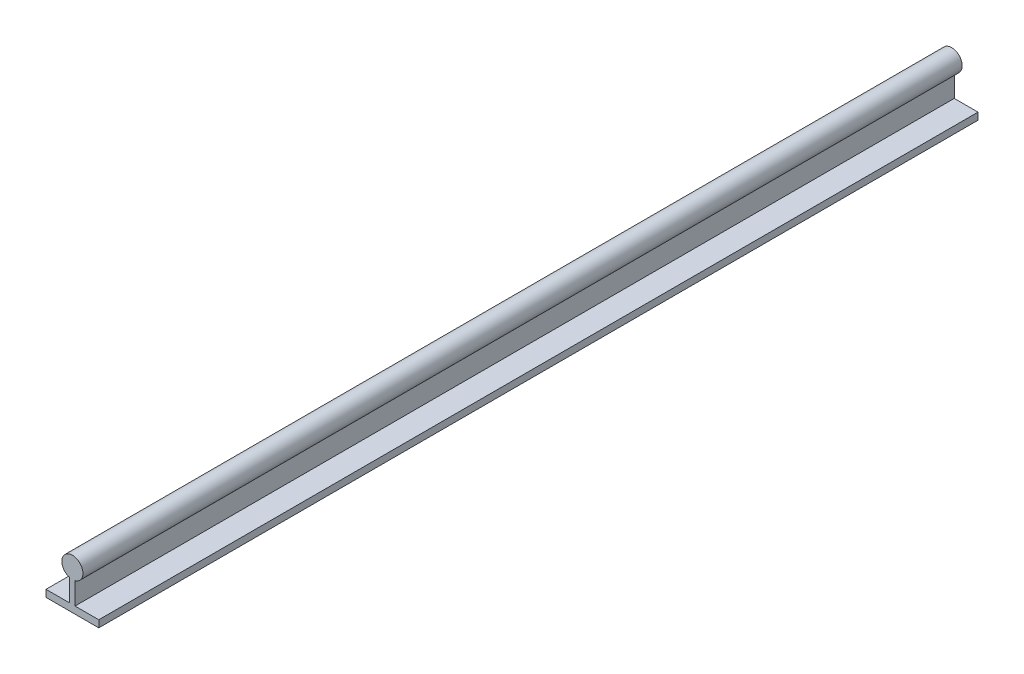
ISO-10303-21;
HEADER;
FILE_DESCRIPTION(('STEP AP214'),'2;1');
FILE_NAME('part.step','',(''),(''),'','','');
FILE_SCHEMA(('AUTOMOTIVE_DESIGN { 1 0 10303 214 1 1 1 1 }'));
ENDSEC;
DATA;
#1=APPLICATION_CONTEXT('core data for automotive mechanical design processes');
#2=APPLICATION_PROTOCOL_DEFINITION('international standard','automotive_design',2000,#1);
#3=PRODUCT_CONTEXT('',#1,'mechanical');
#4=PRODUCT('Part','Part','',(#3));
#5=PRODUCT_RELATED_PRODUCT_CATEGORY('part','',(#4));
#6=PRODUCT_DEFINITION_FORMATION('','',#4);
#7=PRODUCT_DEFINITION_CONTEXT('part definition',#1,'design');
#8=PRODUCT_DEFINITION('design','',#6,#7);
#9=PRODUCT_DEFINITION_SHAPE('','',#8);
#10=(LENGTH_UNIT() NAMED_UNIT(*) SI_UNIT(.MILLI.,.METRE.));
#11=(NAMED_UNIT(*) PLANE_ANGLE_UNIT() SI_UNIT($,.RADIAN.));
#12=(NAMED_UNIT(*) SI_UNIT($,.STERADIAN.) SOLID_ANGLE_UNIT());
#13=UNCERTAINTY_MEASURE_WITH_UNIT(LENGTH_MEASURE(1.E-05),#10,'distance_accuracy_value','');
#14=(GEOMETRIC_REPRESENTATION_CONTEXT(3) GLOBAL_UNCERTAINTY_ASSIGNED_CONTEXT((#13)) GLOBAL_UNIT_ASSIGNED_CONTEXT((#10,
#11,#12)) REPRESENTATION_CONTEXT('',''));
#15=CARTESIAN_POINT('',(0.,0.,0.));
#16=DIRECTION('',(0.,0.,1.));
#17=DIRECTION('',(1.,0.,0.));
#18=AXIS2_PLACEMENT_3D('',#15,#16,#17);
#19=CARTESIAN_POINT('',(15.,-18.3,500.));
#20=DIRECTION('',(-1.,0.,0.));
#21=DIRECTION('',(0.,0.,1.));
#22=AXIS2_PLACEMENT_3D('',#19,#20,#21);
#23=PLANE('',#22);
#24=DIRECTION('',(0.,1.,0.));
#25=VECTOR('',#24,1.);
#26=CARTESIAN_POINT('',(15.,-18.3,0.));
#27=LINE('',#26,#25);
#28=CARTESIAN_POINT('',(15.,-22.3,0.));
#29=VERTEX_POINT('',#28);
#30=CARTESIAN_POINT('',(15.,-18.3,0.));
#31=VERTEX_POINT('',#30);
#32=EDGE_CURVE('E139',#29,#31,#27,.T.);
#33=ORIENTED_EDGE('',*,*,#32,.T.);
#34=DIRECTION('',(0.,0.,-1.));
#35=VECTOR('',#34,1.);
#36=CARTESIAN_POINT('',(15.,-18.3,500.));
#37=LINE('',#36,#35);
#38=CARTESIAN_POINT('',(15.,-18.3,500.));
#39=VERTEX_POINT('',#38);
#40=EDGE_CURVE('E13',#39,#31,#37,.T.);
#41=ORIENTED_EDGE('',*,*,#40,.F.);
#42=DIRECTION('',(0.,1.,0.));
#43=VECTOR('',#42,1.);
#44=CARTESIAN_POINT('',(15.,-18.3,500.));
#45=LINE('',#44,#43);
#46=CARTESIAN_POINT('',(15.,-22.3,500.));
#47=VERTEX_POINT('',#46);
#48=EDGE_CURVE('E153',#47,#39,#45,.T.);
#49=ORIENTED_EDGE('',*,*,#48,.F.);
#50=DIRECTION('',(0.,0.,-1.));
#51=VECTOR('',#50,1.);
#52=CARTESIAN_POINT('',(15.,-22.3,500.));
#53=LINE('',#52,#51);
#54=EDGE_CURVE('E135',#47,#29,#53,.T.);
#55=ORIENTED_EDGE('',*,*,#54,.T.);
#56=EDGE_LOOP('',(#33,#41,#49,#55));
#57=FACE_BOUND('',#56,.T.);
#58=ADVANCED_FACE('F43',(#57),#23,.F.);
#59=CARTESIAN_POINT('',(1.5,-18.3,500.));
#60=DIRECTION('',(0.,-1.,0.));
#61=DIRECTION('',(1.,0.,0.));
#62=AXIS2_PLACEMENT_3D('',#59,#60,#61);
#63=PLANE('',#62);
#64=DIRECTION('',(-1.,0.,0.));
#65=VECTOR('',#64,1.);
#66=CARTESIAN_POINT('',(1.5,-18.3,0.));
#67=LINE('',#66,#65);
#68=CARTESIAN_POINT('',(1.5,-18.3,0.));
#69=VERTEX_POINT('',#68);
#70=EDGE_CURVE('E142',#31,#69,#67,.T.);
#71=ORIENTED_EDGE('',*,*,#70,.T.);
#72=DIRECTION('',(0.,0.,-1.));
#73=VECTOR('',#72,1.);
#74=CARTESIAN_POINT('',(1.5,-18.3,500.));
#75=LINE('',#74,#73);
#76=CARTESIAN_POINT('',(1.5,-18.3,500.));
#77=VERTEX_POINT('',#76);
#78=EDGE_CURVE('E51',#77,#69,#75,.T.);
#79=ORIENTED_EDGE('',*,*,#78,.F.);
#80=DIRECTION('',(-1.,0.,0.));
#81=VECTOR('',#80,1.);
#82=CARTESIAN_POINT('',(1.5,-18.3,500.));
#83=LINE('',#82,#81);
#84=EDGE_CURVE('E102',#39,#77,#83,.T.);
#85=ORIENTED_EDGE('',*,*,#84,.F.);
#86=ORIENTED_EDGE('',*,*,#40,.T.);
#87=EDGE_LOOP('',(#71,#79,#85,#86));
#88=FACE_BOUND('',#87,.T.);
#89=ADVANCED_FACE('F188',(#88),#63,.F.);
#90=CARTESIAN_POINT('',(1.5,-5.80947501931113,500.));
#91=DIRECTION('',(-1.,0.,0.));
#92=DIRECTION('',(0.,-1.,0.));
#93=AXIS2_PLACEMENT_3D('',#90,#91,#92);
#94=PLANE('',#93);
#95=DIRECTION('',(0.,1.,0.));
#96=VECTOR('',#95,1.);
#97=CARTESIAN_POINT('',(1.5,-5.80947501931113,0.));
#98=LINE('',#97,#96);
#99=CARTESIAN_POINT('',(1.5,-5.80947501931113,0.));
#100=VERTEX_POINT('',#99);
#101=EDGE_CURVE('E144',#69,#100,#98,.T.);
#102=ORIENTED_EDGE('',*,*,#101,.T.);
#103=DIRECTION('',(0.,0.,-1.));
#104=VECTOR('',#103,1.);
#105=CARTESIAN_POINT('',(1.5,-5.80947501931113,500.));
#106=LINE('',#105,#104);
#107=CARTESIAN_POINT('',(1.5,-5.80947501931113,500.));
#108=VERTEX_POINT('',#107);
#109=EDGE_CURVE('E160',#108,#100,#106,.T.);
#110=ORIENTED_EDGE('',*,*,#109,.F.);
#111=DIRECTION('',(0.,1.,0.));
#112=VECTOR('',#111,1.);
#113=CARTESIAN_POINT('',(1.5,-5.80947501931113,500.));
#114=LINE('',#113,#112);
#115=EDGE_CURVE('E168',#77,#108,#114,.T.);
#116=ORIENTED_EDGE('',*,*,#115,.F.);
#117=ORIENTED_EDGE('',*,*,#78,.T.);
#118=EDGE_LOOP('',(#102,#110,#116,#117));
#119=FACE_BOUND('',#118,.T.);
#120=ADVANCED_FACE('F166',(#119),#94,.F.);
#121=CARTESIAN_POINT('',(0.,0.,500.));
#122=DIRECTION('',(0.,0.,-1.));
#123=DIRECTION('',(-1.,0.,0.));
#124=AXIS2_PLACEMENT_3D('',#121,#122,#123);
#125=CYLINDRICAL_SURFACE('',#124,6.);
#126=CARTESIAN_POINT('',(0.,0.,0.));
#127=DIRECTION('',(0.,0.,1.));
#128=DIRECTION('',(1.,0.,0.));
#129=AXIS2_PLACEMENT_3D('',#126,#127,#128);
#130=CIRCLE('',#129,6.);
#131=CARTESIAN_POINT('',(-1.5,-5.80947501931113,0.));
#132=VERTEX_POINT('',#131);
#133=EDGE_CURVE('E146',#100,#132,#130,.T.);
#134=ORIENTED_EDGE('',*,*,#133,.T.);
#135=DIRECTION('',(0.,0.,-1.));
#136=VECTOR('',#135,1.);
#137=CARTESIAN_POINT('',(-1.5,-5.80947501931113,500.));
#138=LINE('',#137,#136);
#139=CARTESIAN_POINT('',(-1.5,-5.80947501931113,500.));
#140=VERTEX_POINT('',#139);
#141=EDGE_CURVE('E157',#140,#132,#138,.T.);
#142=ORIENTED_EDGE('',*,*,#141,.F.);
#143=CARTESIAN_POINT('',(0.,0.,500.));
#144=DIRECTION('',(0.,0.,1.));
#145=DIRECTION('',(1.,0.,0.));
#146=AXIS2_PLACEMENT_3D('',#143,#144,#145);
#147=CIRCLE('',#146,6.);
#148=EDGE_CURVE('E180',#108,#140,#147,.T.);
#149=ORIENTED_EDGE('',*,*,#148,.F.);
#150=ORIENTED_EDGE('',*,*,#109,.T.);
#151=EDGE_LOOP('',(#134,#142,#149,#150));
#152=FACE_BOUND('',#151,.T.);
#153=ADVANCED_FACE('F176',(#152),#125,.T.);
#154=CARTESIAN_POINT('',(-1.5,-5.80947501931113,500.));
#155=DIRECTION('',(1.,0.,0.));
#156=DIRECTION('',(0.,1.,0.));
#157=AXIS2_PLACEMENT_3D('',#154,#155,#156);
#158=PLANE('',#157);
#159=DIRECTION('',(0.,-1.,0.));
#160=VECTOR('',#159,1.);
#161=CARTESIAN_POINT('',(-1.5,-5.80947501931113,0.));
#162=LINE('',#161,#160);
#163=CARTESIAN_POINT('',(-1.5,-18.3,0.));
#164=VERTEX_POINT('',#163);
#165=EDGE_CURVE('E148',#132,#164,#162,.T.);
#166=ORIENTED_EDGE('',*,*,#165,.T.);
#167=DIRECTION('',(0.,0.,-1.));
#168=VECTOR('',#167,1.);
#169=CARTESIAN_POINT('',(-1.5,-18.3,500.));
#170=LINE('',#169,#168);
#171=CARTESIAN_POINT('',(-1.5,-18.3,500.));
#172=VERTEX_POINT('',#171);
#173=EDGE_CURVE('E130',#172,#164,#170,.T.);
#174=ORIENTED_EDGE('',*,*,#173,.F.);
#175=DIRECTION('',(0.,-1.,0.));
#176=VECTOR('',#175,1.);
#177=CARTESIAN_POINT('',(-1.5,-5.80947501931113,500.));
#178=LINE('',#177,#176);
#179=EDGE_CURVE('E121',#140,#172,#178,.T.);
#180=ORIENTED_EDGE('',*,*,#179,.F.);
#181=ORIENTED_EDGE('',*,*,#141,.T.);
#182=EDGE_LOOP('',(#166,#174,#180,#181));
#183=FACE_BOUND('',#182,.T.);
#184=ADVANCED_FACE('F179',(#183),#158,.F.);
#185=CARTESIAN_POINT('',(-15.,-18.3,500.));
#186=DIRECTION('',(0.,-1.,0.));
#187=DIRECTION('',(1.,0.,0.));
#188=AXIS2_PLACEMENT_3D('',#185,#186,#187);
#189=PLANE('',#188);
#190=DIRECTION('',(-1.,0.,0.));
#191=VECTOR('',#190,1.);
#192=CARTESIAN_POINT('',(-15.,-18.3,0.));
#193=LINE('',#192,#191);
#194=CARTESIAN_POINT('',(-15.,-18.3,0.));
#195=VERTEX_POINT('',#194);
#196=EDGE_CURVE('E129',#164,#195,#193,.T.);
#197=ORIENTED_EDGE('',*,*,#196,.T.);
#198=DIRECTION('',(0.,0.,-1.));
#199=VECTOR('',#198,1.);
#200=CARTESIAN_POINT('',(-15.,-18.3,500.));
#201=LINE('',#200,#199);
#202=CARTESIAN_POINT('',(-15.,-18.3,500.));
#203=VERTEX_POINT('',#202);
#204=EDGE_CURVE('E126',#203,#195,#201,.T.);
#205=ORIENTED_EDGE('',*,*,#204,.F.);
#206=DIRECTION('',(-1.,0.,0.));
#207=VECTOR('',#206,1.);
#208=CARTESIAN_POINT('',(-15.,-18.3,500.));
#209=LINE('',#208,#207);
#210=EDGE_CURVE('E115',#172,#203,#209,.T.);
#211=ORIENTED_EDGE('',*,*,#210,.F.);
#212=ORIENTED_EDGE('',*,*,#173,.T.);
#213=EDGE_LOOP('',(#197,#205,#211,#212));
#214=FACE_BOUND('',#213,.T.);
#215=ADVANCED_FACE('F127',(#214),#189,.F.);
#216=CARTESIAN_POINT('',(-15.,-18.3,500.));
#217=DIRECTION('',(1.,0.,0.));
#218=DIRECTION('',(0.,0.,-1.));
#219=AXIS2_PLACEMENT_3D('',#216,#217,#218);
#220=PLANE('',#219);
#221=DIRECTION('',(0.,-1.,0.));
#222=VECTOR('',#221,1.);
#223=CARTESIAN_POINT('',(-15.,-18.3,0.));
#224=LINE('',#223,#222);
#225=CARTESIAN_POINT('',(-15.,-22.3,0.));
#226=VERTEX_POINT('',#225);
#227=EDGE_CURVE('E88',#195,#226,#224,.T.);
#228=ORIENTED_EDGE('',*,*,#227,.T.);
#229=DIRECTION('',(0.,0.,-1.));
#230=VECTOR('',#229,1.);
#231=CARTESIAN_POINT('',(-15.,-22.3,500.));
#232=LINE('',#231,#230);
#233=CARTESIAN_POINT('',(-15.,-22.3,500.));
#234=VERTEX_POINT('',#233);
#235=EDGE_CURVE('E131',#234,#226,#232,.T.);
#236=ORIENTED_EDGE('',*,*,#235,.F.);
#237=DIRECTION('',(0.,-1.,0.));
#238=VECTOR('',#237,1.);
#239=CARTESIAN_POINT('',(-15.,-18.3,500.));
#240=LINE('',#239,#238);
#241=EDGE_CURVE('E119',#203,#234,#240,.T.);
#242=ORIENTED_EDGE('',*,*,#241,.F.);
#243=ORIENTED_EDGE('',*,*,#204,.T.);
#244=EDGE_LOOP('',(#228,#236,#242,#243));
#245=FACE_BOUND('',#244,.T.);
#246=ADVANCED_FACE('F133',(#245),#220,.F.);
#247=CARTESIAN_POINT('',(-15.,-22.3,500.));
#248=DIRECTION('',(0.,1.,0.));
#249=DIRECTION('',(0.,0.,1.));
#250=AXIS2_PLACEMENT_3D('',#247,#248,#249);
#251=PLANE('',#250);
#252=DIRECTION('',(1.,0.,0.));
#253=VECTOR('',#252,1.);
#254=CARTESIAN_POINT('',(-15.,-22.3,0.));
#255=LINE('',#254,#253);
#256=EDGE_CURVE('E94',#226,#29,#255,.T.);
#257=ORIENTED_EDGE('',*,*,#256,.T.);
#258=ORIENTED_EDGE('',*,*,#54,.F.);
#259=DIRECTION('',(1.,0.,0.));
#260=VECTOR('',#259,1.);
#261=CARTESIAN_POINT('',(-15.,-22.3,500.));
#262=LINE('',#261,#260);
#263=EDGE_CURVE('E59',#234,#47,#262,.T.);
#264=ORIENTED_EDGE('',*,*,#263,.F.);
#265=ORIENTED_EDGE('',*,*,#235,.T.);
#266=EDGE_LOOP('',(#257,#258,#264,#265));
#267=FACE_BOUND('',#266,.T.);
#268=ADVANCED_FACE('F204',(#267),#251,.F.);
#269=CARTESIAN_POINT('',(0.,0.,500.));
#270=DIRECTION('',(0.,0.,1.));
#271=DIRECTION('',(1.,0.,0.));
#272=AXIS2_PLACEMENT_3D('',#269,#270,#271);
#273=PLANE('',#272);
#274=ORIENTED_EDGE('',*,*,#48,.T.);
#275=ORIENTED_EDGE('',*,*,#84,.T.);
#276=ORIENTED_EDGE('',*,*,#115,.T.);
#277=ORIENTED_EDGE('',*,*,#148,.T.);
#278=ORIENTED_EDGE('',*,*,#179,.T.);
#279=ORIENTED_EDGE('',*,*,#210,.T.);
#280=ORIENTED_EDGE('',*,*,#241,.T.);
#281=ORIENTED_EDGE('',*,*,#263,.T.);
#282=EDGE_LOOP('',(#274,#275,#276,#277,#278,#279,#280,#281));
#283=FACE_BOUND('',#282,.T.);
#284=ADVANCED_FACE('F117',(#283),#273,.T.);
#285=CARTESIAN_POINT('',(0.,0.,0.));
#286=DIRECTION('',(0.,0.,1.));
#287=DIRECTION('',(1.,0.,0.));
#288=AXIS2_PLACEMENT_3D('',#285,#286,#287);
#289=PLANE('',#288);
#290=ORIENTED_EDGE('',*,*,#32,.F.);
#291=ORIENTED_EDGE('',*,*,#256,.F.);
#292=ORIENTED_EDGE('',*,*,#227,.F.);
#293=ORIENTED_EDGE('',*,*,#196,.F.);
#294=ORIENTED_EDGE('',*,*,#165,.F.);
#295=ORIENTED_EDGE('',*,*,#133,.F.);
#296=ORIENTED_EDGE('',*,*,#101,.F.);
#297=ORIENTED_EDGE('',*,*,#70,.F.);
#298=EDGE_LOOP('',(#290,#291,#292,#293,#294,#295,#296,#297));
#299=FACE_BOUND('',#298,.T.);
#300=ADVANCED_FACE('F172',(#299),#289,.F.);
#301=CLOSED_SHELL('',(#58,#89,#120,#153,#184,#215,#246,#268,#284,#300));
#302=MANIFOLD_SOLID_BREP('B2',#301);
#303=ADVANCED_BREP_SHAPE_REPRESENTATION('',(#18,#302),#14);
#304=SHAPE_DEFINITION_REPRESENTATION(#9,#303);
ENDSEC;
END-ISO-10303-21;
